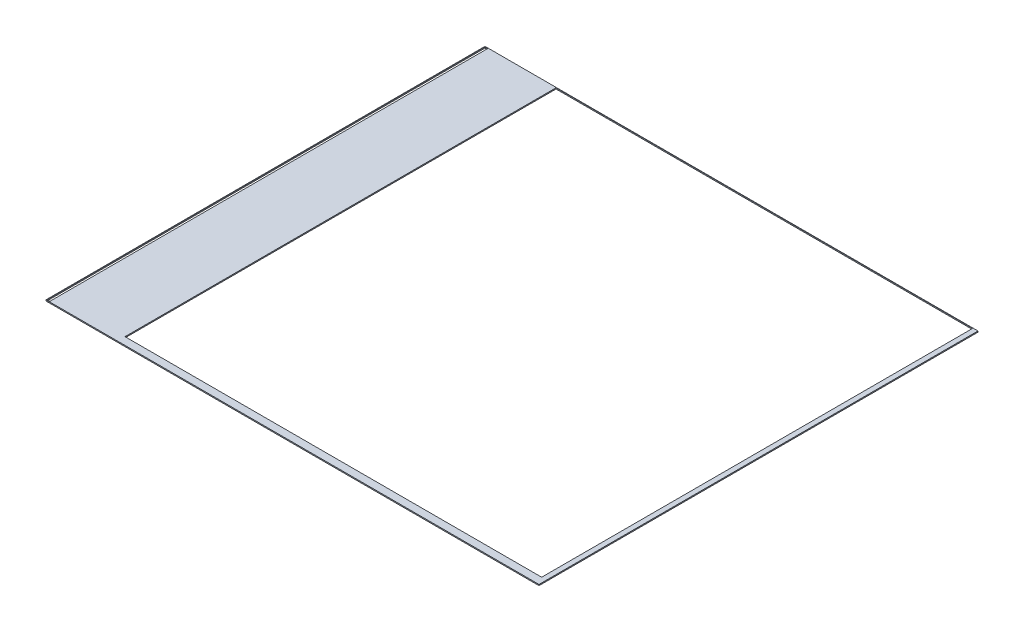
ISO-10303-21;
HEADER;
FILE_DESCRIPTION(('STEP AP214'),'2;1');
FILE_NAME('part.step','',(''),(''),'','','');
FILE_SCHEMA(('AUTOMOTIVE_DESIGN { 1 0 10303 214 1 1 1 1 }'));
ENDSEC;
DATA;
#1=APPLICATION_CONTEXT('core data for automotive mechanical design processes');
#2=APPLICATION_PROTOCOL_DEFINITION('international standard','automotive_design',2000,#1);
#3=PRODUCT_CONTEXT('',#1,'mechanical');
#4=PRODUCT('Part','Part','',(#3));
#5=PRODUCT_RELATED_PRODUCT_CATEGORY('part','',(#4));
#6=PRODUCT_DEFINITION_FORMATION('','',#4);
#7=PRODUCT_DEFINITION_CONTEXT('part definition',#1,'design');
#8=PRODUCT_DEFINITION('design','',#6,#7);
#9=PRODUCT_DEFINITION_SHAPE('','',#8);
#10=(LENGTH_UNIT() NAMED_UNIT(*) SI_UNIT(.MILLI.,.METRE.));
#11=(NAMED_UNIT(*) PLANE_ANGLE_UNIT() SI_UNIT($,.RADIAN.));
#12=(NAMED_UNIT(*) SI_UNIT($,.STERADIAN.) SOLID_ANGLE_UNIT());
#13=UNCERTAINTY_MEASURE_WITH_UNIT(LENGTH_MEASURE(1.E-05),#10,'distance_accuracy_value','');
#14=(GEOMETRIC_REPRESENTATION_CONTEXT(3) GLOBAL_UNCERTAINTY_ASSIGNED_CONTEXT((#13)) GLOBAL_UNIT_ASSIGNED_CONTEXT((#10,
#11,#12)) REPRESENTATION_CONTEXT('',''));
#15=CARTESIAN_POINT('',(0.,0.,0.));
#16=DIRECTION('',(0.,0.,1.));
#17=DIRECTION('',(1.,0.,0.));
#18=AXIS2_PLACEMENT_3D('',#15,#16,#17);
#19=CARTESIAN_POINT('',(-11.365,0.05,-10.12));
#20=DIRECTION('',(1.,0.,0.));
#21=DIRECTION('',(0.,0.,-1.));
#22=AXIS2_PLACEMENT_3D('',#19,#20,#21);
#23=PLANE('',#22);
#24=DIRECTION('',(0.,0.,1.));
#25=VECTOR('',#24,1.);
#26=CARTESIAN_POINT('',(-11.365,0.,-10.12));
#27=LINE('',#26,#25);
#28=CARTESIAN_POINT('',(-11.365,0.,-10.12));
#29=VERTEX_POINT('',#28);
#30=CARTESIAN_POINT('',(-11.365,0.,10.12));
#31=VERTEX_POINT('',#30);
#32=EDGE_CURVE('E234',#29,#31,#27,.T.);
#33=ORIENTED_EDGE('',*,*,#32,.T.);
#34=DIRECTION('',(0.,-1.,0.));
#35=VECTOR('',#34,1.);
#36=CARTESIAN_POINT('',(-11.365,0.05,10.12));
#37=LINE('',#36,#35);
#38=CARTESIAN_POINT('',(-11.365,0.05,10.12));
#39=VERTEX_POINT('',#38);
#40=EDGE_CURVE('E11',#39,#31,#37,.T.);
#41=ORIENTED_EDGE('',*,*,#40,.F.);
#42=DIRECTION('',(0.,0.,1.));
#43=VECTOR('',#42,1.);
#44=CARTESIAN_POINT('',(-11.365,0.05,-10.12));
#45=LINE('',#44,#43);
#46=CARTESIAN_POINT('',(-11.365,0.05,-10.12));
#47=VERTEX_POINT('',#46);
#48=EDGE_CURVE('E244',#47,#39,#45,.T.);
#49=ORIENTED_EDGE('',*,*,#48,.F.);
#50=DIRECTION('',(0.,-1.,0.));
#51=VECTOR('',#50,1.);
#52=CARTESIAN_POINT('',(-11.365,0.05,-10.12));
#53=LINE('',#52,#51);
#54=EDGE_CURVE('E258',#47,#29,#53,.T.);
#55=ORIENTED_EDGE('',*,*,#54,.T.);
#56=EDGE_LOOP('',(#33,#41,#49,#55));
#57=FACE_BOUND('',#56,.T.);
#58=ADVANCED_FACE('F38',(#57),#23,.F.);
#59=CARTESIAN_POINT('',(-11.365,0.05,10.12));
#60=DIRECTION('',(0.,0.,-1.));
#61=DIRECTION('',(-1.,0.,0.));
#62=AXIS2_PLACEMENT_3D('',#59,#60,#61);
#63=PLANE('',#62);
#64=DIRECTION('',(1.,0.,0.));
#65=VECTOR('',#64,1.);
#66=CARTESIAN_POINT('',(-11.365,0.,10.12));
#67=LINE('',#66,#65);
#68=CARTESIAN_POINT('',(11.365,0.,10.12));
#69=VERTEX_POINT('',#68);
#70=EDGE_CURVE('E262',#31,#69,#67,.T.);
#71=ORIENTED_EDGE('',*,*,#70,.T.);
#72=DIRECTION('',(0.,-1.,0.));
#73=VECTOR('',#72,1.);
#74=CARTESIAN_POINT('',(11.365,0.05,10.12));
#75=LINE('',#74,#73);
#76=CARTESIAN_POINT('',(11.365,0.05,10.12));
#77=VERTEX_POINT('',#76);
#78=EDGE_CURVE('E46',#77,#69,#75,.T.);
#79=ORIENTED_EDGE('',*,*,#78,.F.);
#80=DIRECTION('',(1.,0.,0.));
#81=VECTOR('',#80,1.);
#82=CARTESIAN_POINT('',(-11.365,0.05,10.12));
#83=LINE('',#82,#81);
#84=EDGE_CURVE('E248',#39,#77,#83,.T.);
#85=ORIENTED_EDGE('',*,*,#84,.F.);
#86=ORIENTED_EDGE('',*,*,#40,.T.);
#87=EDGE_LOOP('',(#71,#79,#85,#86));
#88=FACE_BOUND('',#87,.T.);
#89=ADVANCED_FACE('F297',(#88),#63,.F.);
#90=CARTESIAN_POINT('',(11.365,0.05,-10.12));
#91=DIRECTION('',(-1.,0.,0.));
#92=DIRECTION('',(0.,0.,1.));
#93=AXIS2_PLACEMENT_3D('',#90,#91,#92);
#94=PLANE('',#93);
#95=DIRECTION('',(0.,0.,-1.));
#96=VECTOR('',#95,1.);
#97=CARTESIAN_POINT('',(11.365,0.,-10.12));
#98=LINE('',#97,#96);
#99=CARTESIAN_POINT('',(11.365,0.,-10.12));
#100=VERTEX_POINT('',#99);
#101=EDGE_CURVE('E265',#69,#100,#98,.T.);
#102=ORIENTED_EDGE('',*,*,#101,.T.);
#103=DIRECTION('',(0.,-1.,0.));
#104=VECTOR('',#103,1.);
#105=CARTESIAN_POINT('',(11.365,0.05,-10.12));
#106=LINE('',#105,#104);
#107=CARTESIAN_POINT('',(11.365,0.05,-10.12));
#108=VERTEX_POINT('',#107);
#109=EDGE_CURVE('E273',#108,#100,#106,.T.);
#110=ORIENTED_EDGE('',*,*,#109,.F.);
#111=DIRECTION('',(0.,0.,-1.));
#112=VECTOR('',#111,1.);
#113=CARTESIAN_POINT('',(11.365,0.05,-10.12));
#114=LINE('',#113,#112);
#115=EDGE_CURVE('E252',#77,#108,#114,.T.);
#116=ORIENTED_EDGE('',*,*,#115,.F.);
#117=ORIENTED_EDGE('',*,*,#78,.T.);
#118=EDGE_LOOP('',(#102,#110,#116,#117));
#119=FACE_BOUND('',#118,.T.);
#120=ADVANCED_FACE('F282',(#119),#94,.F.);
#121=CARTESIAN_POINT('',(-11.365,0.05,-10.12));
#122=DIRECTION('',(0.,0.,1.));
#123=DIRECTION('',(1.,0.,0.));
#124=AXIS2_PLACEMENT_3D('',#121,#122,#123);
#125=PLANE('',#124);
#126=DIRECTION('',(-1.,0.,0.));
#127=VECTOR('',#126,1.);
#128=CARTESIAN_POINT('',(-11.365,0.,-10.12));
#129=LINE('',#128,#127);
#130=EDGE_CURVE('E249',#100,#29,#129,.T.);
#131=ORIENTED_EDGE('',*,*,#130,.T.);
#132=ORIENTED_EDGE('',*,*,#54,.F.);
#133=DIRECTION('',(-1.,0.,0.));
#134=VECTOR('',#133,1.);
#135=CARTESIAN_POINT('',(-11.365,0.05,-10.12));
#136=LINE('',#135,#134);
#137=EDGE_CURVE('E255',#108,#47,#136,.T.);
#138=ORIENTED_EDGE('',*,*,#137,.F.);
#139=ORIENTED_EDGE('',*,*,#109,.T.);
#140=EDGE_LOOP('',(#131,#132,#138,#139));
#141=FACE_BOUND('',#140,.T.);
#142=ADVANCED_FACE('F291',(#141),#125,.F.);
#143=CARTESIAN_POINT('',(-11.365,0.05,10.12));
#144=DIRECTION('',(0.,1.,0.));
#145=DIRECTION('',(0.,0.,1.));
#146=AXIS2_PLACEMENT_3D('',#143,#144,#145);
#147=PLANE('',#146);
#148=DIRECTION('',(0.,0.,-1.));
#149=VECTOR('',#148,1.);
#150=CARTESIAN_POINT('',(-8.0718,0.05,-10.101375));
#151=LINE('',#150,#149);
#152=CARTESIAN_POINT('',(-8.0718,0.05,9.770625));
#153=VERTEX_POINT('',#152);
#154=CARTESIAN_POINT('',(-8.0718,0.05,-10.101375));
#155=VERTEX_POINT('',#154);
#156=EDGE_CURVE('E153',#153,#155,#151,.T.);
#157=ORIENTED_EDGE('',*,*,#156,.T.);
#158=DIRECTION('',(1.,0.,0.));
#159=VECTOR('',#158,1.);
#160=CARTESIAN_POINT('',(11.1378,0.05,-10.101375));
#161=LINE('',#160,#159);
#162=CARTESIAN_POINT('',(11.1378,0.05,-10.101375));
#163=VERTEX_POINT('',#162);
#164=EDGE_CURVE('E163',#155,#163,#161,.T.);
#165=ORIENTED_EDGE('',*,*,#164,.T.);
#166=DIRECTION('',(0.,0.,1.));
#167=VECTOR('',#166,1.);
#168=CARTESIAN_POINT('',(11.1378,0.05,9.770625));
#169=LINE('',#168,#167);
#170=CARTESIAN_POINT('',(11.1378,0.05,9.770625));
#171=VERTEX_POINT('',#170);
#172=EDGE_CURVE('E56',#163,#171,#169,.T.);
#173=ORIENTED_EDGE('',*,*,#172,.T.);
#174=DIRECTION('',(-1.,0.,0.));
#175=VECTOR('',#174,1.);
#176=CARTESIAN_POINT('',(-8.0718,0.05,9.770625));
#177=LINE('',#176,#175);
#178=EDGE_CURVE('E160',#171,#153,#177,.T.);
#179=ORIENTED_EDGE('',*,*,#178,.T.);
#180=EDGE_LOOP('',(#157,#165,#173,#179));
#181=FACE_BOUND('',#180,.T.);
#182=DIRECTION('',(0.,0.,-1.));
#183=VECTOR('',#182,1.);
#184=CARTESIAN_POINT('',(-11.3446,0.05,-10.09685));
#185=LINE('',#184,#183);
#186=CARTESIAN_POINT('',(-11.3446,0.05,10.08815));
#187=VERTEX_POINT('',#186);
#188=CARTESIAN_POINT('',(-11.3446,0.05,-10.09685));
#189=VERTEX_POINT('',#188);
#190=EDGE_CURVE('E200',#187,#189,#185,.T.);
#191=ORIENTED_EDGE('',*,*,#190,.T.);
#192=DIRECTION('',(1.,0.,0.));
#193=VECTOR('',#192,1.);
#194=CARTESIAN_POINT('',(-11.2146,0.05,-10.09685));
#195=LINE('',#194,#193);
#196=CARTESIAN_POINT('',(-11.2146,0.05,-10.09685));
#197=VERTEX_POINT('',#196);
#198=EDGE_CURVE('E204',#189,#197,#195,.T.);
#199=ORIENTED_EDGE('',*,*,#198,.T.);
#200=DIRECTION('',(0.,0.,1.));
#201=VECTOR('',#200,1.);
#202=CARTESIAN_POINT('',(-11.2146,0.05,10.08815));
#203=LINE('',#202,#201);
#204=CARTESIAN_POINT('',(-11.2146,0.05,10.08815));
#205=VERTEX_POINT('',#204);
#206=EDGE_CURVE('E209',#197,#205,#203,.T.);
#207=ORIENTED_EDGE('',*,*,#206,.T.);
#208=DIRECTION('',(-1.,0.,0.));
#209=VECTOR('',#208,1.);
#210=CARTESIAN_POINT('',(-11.3446,0.05,10.08815));
#211=LINE('',#210,#209);
#212=EDGE_CURVE('E213',#205,#187,#211,.T.);
#213=ORIENTED_EDGE('',*,*,#212,.T.);
#214=EDGE_LOOP('',(#191,#199,#207,#213));
#215=FACE_BOUND('',#214,.T.);
#216=ORIENTED_EDGE('',*,*,#48,.T.);
#217=ORIENTED_EDGE('',*,*,#84,.T.);
#218=ORIENTED_EDGE('',*,*,#115,.T.);
#219=ORIENTED_EDGE('',*,*,#137,.T.);
#220=EDGE_LOOP('',(#216,#217,#218,#219));
#221=FACE_BOUND('',#220,.T.);
#222=ADVANCED_FACE('F168',(#181,#215,#221),#147,.T.);
#223=CARTESIAN_POINT('',(-11.365,0.,10.12));
#224=DIRECTION('',(0.,1.,0.));
#225=DIRECTION('',(0.,0.,1.));
#226=AXIS2_PLACEMENT_3D('',#223,#224,#225);
#227=PLANE('',#226);
#228=DIRECTION('',(1.,0.,0.));
#229=VECTOR('',#228,1.);
#230=CARTESIAN_POINT('',(11.1378,0.,-10.101375));
#231=LINE('',#230,#229);
#232=CARTESIAN_POINT('',(-8.0718,0.,-10.101375));
#233=VERTEX_POINT('',#232);
#234=CARTESIAN_POINT('',(11.1378,0.,-10.101375));
#235=VERTEX_POINT('',#234);
#236=EDGE_CURVE('E185',#233,#235,#231,.T.);
#237=ORIENTED_EDGE('',*,*,#236,.F.);
#238=DIRECTION('',(0.,0.,-1.));
#239=VECTOR('',#238,1.);
#240=CARTESIAN_POINT('',(-8.0718,0.,-10.101375));
#241=LINE('',#240,#239);
#242=CARTESIAN_POINT('',(-8.0718,0.,9.770625));
#243=VERTEX_POINT('',#242);
#244=EDGE_CURVE('E67',#243,#233,#241,.T.);
#245=ORIENTED_EDGE('',*,*,#244,.F.);
#246=DIRECTION('',(-1.,0.,0.));
#247=VECTOR('',#246,1.);
#248=CARTESIAN_POINT('',(-8.0718,0.,9.770625));
#249=LINE('',#248,#247);
#250=CARTESIAN_POINT('',(11.1378,0.,9.770625));
#251=VERTEX_POINT('',#250);
#252=EDGE_CURVE('E172',#251,#243,#249,.T.);
#253=ORIENTED_EDGE('',*,*,#252,.F.);
#254=DIRECTION('',(0.,0.,1.));
#255=VECTOR('',#254,1.);
#256=CARTESIAN_POINT('',(11.1378,0.,9.770625));
#257=LINE('',#256,#255);
#258=EDGE_CURVE('E177',#235,#251,#257,.T.);
#259=ORIENTED_EDGE('',*,*,#258,.F.);
#260=EDGE_LOOP('',(#237,#245,#253,#259));
#261=FACE_BOUND('',#260,.T.);
#262=DIRECTION('',(1.,0.,0.));
#263=VECTOR('',#262,1.);
#264=CARTESIAN_POINT('',(-11.2146,0.,-10.09685));
#265=LINE('',#264,#263);
#266=CARTESIAN_POINT('',(-11.3446,0.,-10.09685));
#267=VERTEX_POINT('',#266);
#268=CARTESIAN_POINT('',(-11.2146,0.,-10.09685));
#269=VERTEX_POINT('',#268);
#270=EDGE_CURVE('E220',#267,#269,#265,.T.);
#271=ORIENTED_EDGE('',*,*,#270,.F.);
#272=DIRECTION('',(0.,0.,-1.));
#273=VECTOR('',#272,1.);
#274=CARTESIAN_POINT('',(-11.3446,0.,-10.09685));
#275=LINE('',#274,#273);
#276=CARTESIAN_POINT('',(-11.3446,0.,10.08815));
#277=VERTEX_POINT('',#276);
#278=EDGE_CURVE('E194',#277,#267,#275,.T.);
#279=ORIENTED_EDGE('',*,*,#278,.F.);
#280=DIRECTION('',(-1.,0.,0.));
#281=VECTOR('',#280,1.);
#282=CARTESIAN_POINT('',(-11.3446,0.,10.08815));
#283=LINE('',#282,#281);
#284=CARTESIAN_POINT('',(-11.2146,0.,10.08815));
#285=VERTEX_POINT('',#284);
#286=EDGE_CURVE('E205',#285,#277,#283,.T.);
#287=ORIENTED_EDGE('',*,*,#286,.F.);
#288=DIRECTION('',(0.,0.,1.));
#289=VECTOR('',#288,1.);
#290=CARTESIAN_POINT('',(-11.2146,0.,10.08815));
#291=LINE('',#290,#289);
#292=EDGE_CURVE('E224',#269,#285,#291,.T.);
#293=ORIENTED_EDGE('',*,*,#292,.F.);
#294=EDGE_LOOP('',(#271,#279,#287,#293));
#295=FACE_BOUND('',#294,.T.);
#296=ORIENTED_EDGE('',*,*,#32,.F.);
#297=ORIENTED_EDGE('',*,*,#130,.F.);
#298=ORIENTED_EDGE('',*,*,#101,.F.);
#299=ORIENTED_EDGE('',*,*,#70,.F.);
#300=EDGE_LOOP('',(#296,#297,#298,#299));
#301=FACE_BOUND('',#300,.T.);
#302=ADVANCED_FACE('F288',(#261,#295,#301),#227,.F.);
#303=CARTESIAN_POINT('',(-11.3446,0.05,-10.09685));
#304=DIRECTION('',(-1.,0.,0.));
#305=DIRECTION('',(0.,0.,1.));
#306=AXIS2_PLACEMENT_3D('',#303,#304,#305);
#307=PLANE('',#306);
#308=ORIENTED_EDGE('',*,*,#278,.T.);
#309=DIRECTION('',(0.,-1.,0.));
#310=VECTOR('',#309,1.);
#311=CARTESIAN_POINT('',(-11.3446,0.05,-10.09685));
#312=LINE('',#311,#310);
#313=EDGE_CURVE('E217',#189,#267,#312,.T.);
#314=ORIENTED_EDGE('',*,*,#313,.F.);
#315=ORIENTED_EDGE('',*,*,#190,.F.);
#316=DIRECTION('',(0.,-1.,0.));
#317=VECTOR('',#316,1.);
#318=CARTESIAN_POINT('',(-11.3446,0.05,10.08815));
#319=LINE('',#318,#317);
#320=EDGE_CURVE('E231',#187,#277,#319,.T.);
#321=ORIENTED_EDGE('',*,*,#320,.T.);
#322=EDGE_LOOP('',(#308,#314,#315,#321));
#323=FACE_BOUND('',#322,.T.);
#324=ADVANCED_FACE('F309',(#323),#307,.F.);
#325=CARTESIAN_POINT('',(-11.3446,0.05,10.08815));
#326=DIRECTION('',(0.,0.,1.));
#327=DIRECTION('',(1.,0.,0.));
#328=AXIS2_PLACEMENT_3D('',#325,#326,#327);
#329=PLANE('',#328);
#330=ORIENTED_EDGE('',*,*,#286,.T.);
#331=ORIENTED_EDGE('',*,*,#320,.F.);
#332=ORIENTED_EDGE('',*,*,#212,.F.);
#333=DIRECTION('',(0.,-1.,0.));
#334=VECTOR('',#333,1.);
#335=CARTESIAN_POINT('',(-11.2146,0.05,10.08815));
#336=LINE('',#335,#334);
#337=EDGE_CURVE('E235',#205,#285,#336,.T.);
#338=ORIENTED_EDGE('',*,*,#337,.T.);
#339=EDGE_LOOP('',(#330,#331,#332,#338));
#340=FACE_BOUND('',#339,.T.);
#341=ADVANCED_FACE('F315',(#340),#329,.F.);
#342=CARTESIAN_POINT('',(-11.2146,0.05,10.08815));
#343=DIRECTION('',(1.,0.,0.));
#344=DIRECTION('',(0.,0.,-1.));
#345=AXIS2_PLACEMENT_3D('',#342,#343,#344);
#346=PLANE('',#345);
#347=ORIENTED_EDGE('',*,*,#292,.T.);
#348=ORIENTED_EDGE('',*,*,#337,.F.);
#349=ORIENTED_EDGE('',*,*,#206,.F.);
#350=DIRECTION('',(0.,-1.,0.));
#351=VECTOR('',#350,1.);
#352=CARTESIAN_POINT('',(-11.2146,0.05,-10.09685));
#353=LINE('',#352,#351);
#354=EDGE_CURVE('E238',#197,#269,#353,.T.);
#355=ORIENTED_EDGE('',*,*,#354,.T.);
#356=EDGE_LOOP('',(#347,#348,#349,#355));
#357=FACE_BOUND('',#356,.T.);
#358=ADVANCED_FACE('F320',(#357),#346,.F.);
#359=CARTESIAN_POINT('',(-11.2146,0.05,-10.09685));
#360=DIRECTION('',(0.,0.,-1.));
#361=DIRECTION('',(-1.,0.,0.));
#362=AXIS2_PLACEMENT_3D('',#359,#360,#361);
#363=PLANE('',#362);
#364=ORIENTED_EDGE('',*,*,#270,.T.);
#365=ORIENTED_EDGE('',*,*,#354,.F.);
#366=ORIENTED_EDGE('',*,*,#198,.F.);
#367=ORIENTED_EDGE('',*,*,#313,.T.);
#368=EDGE_LOOP('',(#364,#365,#366,#367));
#369=FACE_BOUND('',#368,.T.);
#370=ADVANCED_FACE('F317',(#369),#363,.F.);
#371=CARTESIAN_POINT('',(-8.0718,0.05,-10.101375));
#372=DIRECTION('',(-1.,0.,0.));
#373=DIRECTION('',(0.,0.,1.));
#374=AXIS2_PLACEMENT_3D('',#371,#372,#373);
#375=PLANE('',#374);
#376=ORIENTED_EDGE('',*,*,#244,.T.);
#377=DIRECTION('',(0.,-1.,0.));
#378=VECTOR('',#377,1.);
#379=CARTESIAN_POINT('',(-8.0718,0.05,-10.101375));
#380=LINE('',#379,#378);
#381=EDGE_CURVE('E149',#155,#233,#380,.T.);
#382=ORIENTED_EDGE('',*,*,#381,.F.);
#383=ORIENTED_EDGE('',*,*,#156,.F.);
#384=DIRECTION('',(0.,-1.,0.));
#385=VECTOR('',#384,1.);
#386=CARTESIAN_POINT('',(-8.0718,0.05,9.770625));
#387=LINE('',#386,#385);
#388=EDGE_CURVE('E191',#153,#243,#387,.T.);
#389=ORIENTED_EDGE('',*,*,#388,.T.);
#390=EDGE_LOOP('',(#376,#382,#383,#389));
#391=FACE_BOUND('',#390,.T.);
#392=ADVANCED_FACE('F151',(#391),#375,.F.);
#393=CARTESIAN_POINT('',(-8.0718,0.05,9.770625));
#394=DIRECTION('',(0.,0.,1.));
#395=DIRECTION('',(1.,0.,0.));
#396=AXIS2_PLACEMENT_3D('',#393,#394,#395);
#397=PLANE('',#396);
#398=ORIENTED_EDGE('',*,*,#252,.T.);
#399=ORIENTED_EDGE('',*,*,#388,.F.);
#400=ORIENTED_EDGE('',*,*,#178,.F.);
#401=DIRECTION('',(0.,-1.,0.));
#402=VECTOR('',#401,1.);
#403=CARTESIAN_POINT('',(11.1378,0.05,9.770625));
#404=LINE('',#403,#402);
#405=EDGE_CURVE('E195',#171,#251,#404,.T.);
#406=ORIENTED_EDGE('',*,*,#405,.T.);
#407=EDGE_LOOP('',(#398,#399,#400,#406));
#408=FACE_BOUND('',#407,.T.);
#409=ADVANCED_FACE('F330',(#408),#397,.F.);
#410=CARTESIAN_POINT('',(11.1378,0.05,9.770625));
#411=DIRECTION('',(1.,0.,0.));
#412=DIRECTION('',(0.,0.,-1.));
#413=AXIS2_PLACEMENT_3D('',#410,#411,#412);
#414=PLANE('',#413);
#415=ORIENTED_EDGE('',*,*,#258,.T.);
#416=ORIENTED_EDGE('',*,*,#405,.F.);
#417=ORIENTED_EDGE('',*,*,#172,.F.);
#418=DIRECTION('',(0.,-1.,0.));
#419=VECTOR('',#418,1.);
#420=CARTESIAN_POINT('',(11.1378,0.05,-10.101375));
#421=LINE('',#420,#419);
#422=EDGE_CURVE('E159',#163,#235,#421,.T.);
#423=ORIENTED_EDGE('',*,*,#422,.T.);
#424=EDGE_LOOP('',(#415,#416,#417,#423));
#425=FACE_BOUND('',#424,.T.);
#426=ADVANCED_FACE('F333',(#425),#414,.F.);
#427=CARTESIAN_POINT('',(11.1378,0.05,-10.101375));
#428=DIRECTION('',(0.,0.,-1.));
#429=DIRECTION('',(-1.,0.,0.));
#430=AXIS2_PLACEMENT_3D('',#427,#428,#429);
#431=PLANE('',#430);
#432=ORIENTED_EDGE('',*,*,#236,.T.);
#433=ORIENTED_EDGE('',*,*,#422,.F.);
#434=ORIENTED_EDGE('',*,*,#164,.F.);
#435=ORIENTED_EDGE('',*,*,#381,.T.);
#436=EDGE_LOOP('',(#432,#433,#434,#435));
#437=FACE_BOUND('',#436,.T.);
#438=ADVANCED_FACE('F164',(#437),#431,.F.);
#439=CLOSED_SHELL('',(#58,#89,#120,#142,#222,#302,#324,#341,#358,#370,#392,#409,#426,#438));
#440=MANIFOLD_SOLID_BREP('B2',#439);
#441=ADVANCED_BREP_SHAPE_REPRESENTATION('',(#18,#440),#14);
#442=SHAPE_DEFINITION_REPRESENTATION(#9,#441);
ENDSEC;
END-ISO-10303-21;
